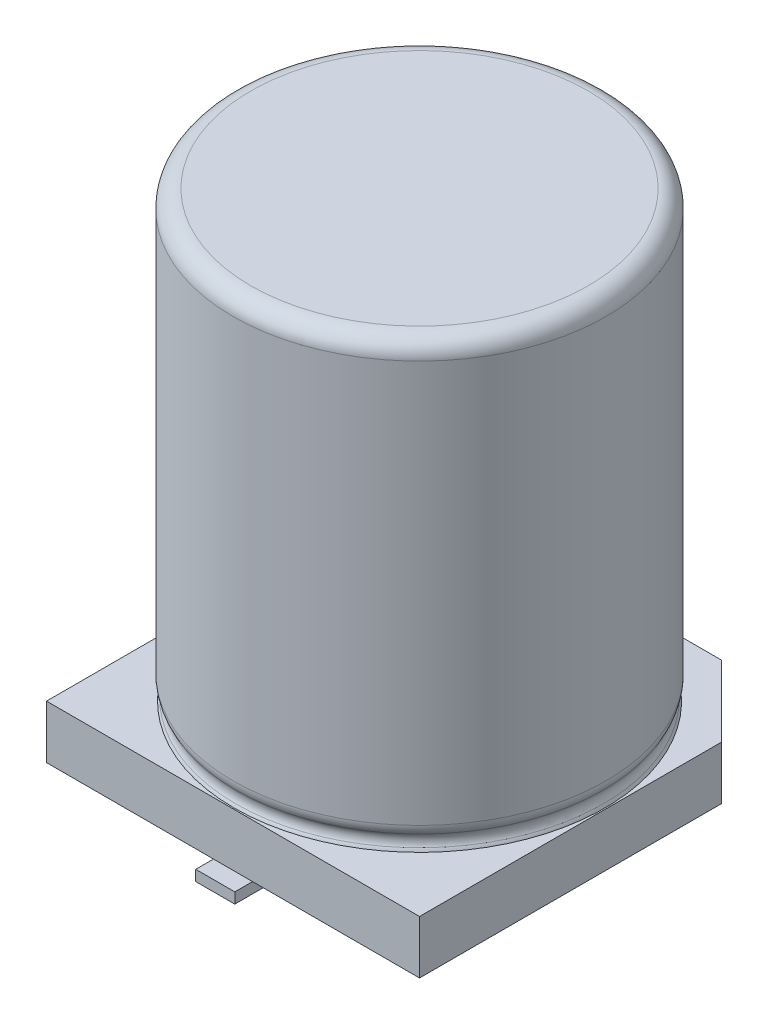
ISO-10303-21;
HEADER;
FILE_DESCRIPTION(('STEP AP214'),'2;1');
FILE_NAME('part.step','',(''),(''),'','','');
FILE_SCHEMA(('AUTOMOTIVE_DESIGN { 1 0 10303 214 1 1 1 1 }'));
ENDSEC;
DATA;
#1=APPLICATION_CONTEXT('core data for automotive mechanical design processes');
#2=APPLICATION_PROTOCOL_DEFINITION('international standard','automotive_design',2000,#1);
#3=PRODUCT_CONTEXT('',#1,'mechanical');
#4=PRODUCT('Part','Part','',(#3));
#5=PRODUCT_RELATED_PRODUCT_CATEGORY('part','',(#4));
#6=PRODUCT_DEFINITION_FORMATION('','',#4);
#7=PRODUCT_DEFINITION_CONTEXT('part definition',#1,'design');
#8=PRODUCT_DEFINITION('design','',#6,#7);
#9=PRODUCT_DEFINITION_SHAPE('','',#8);
#10=(LENGTH_UNIT() NAMED_UNIT(*) SI_UNIT(.MILLI.,.METRE.));
#11=(NAMED_UNIT(*) PLANE_ANGLE_UNIT() SI_UNIT($,.RADIAN.));
#12=(NAMED_UNIT(*) SI_UNIT($,.STERADIAN.) SOLID_ANGLE_UNIT());
#13=UNCERTAINTY_MEASURE_WITH_UNIT(LENGTH_MEASURE(1.E-05),#10,'distance_accuracy_value','');
#14=(GEOMETRIC_REPRESENTATION_CONTEXT(3) GLOBAL_UNCERTAINTY_ASSIGNED_CONTEXT((#13)) GLOBAL_UNIT_ASSIGNED_CONTEXT((#10,
#11,#12)) REPRESENTATION_CONTEXT('',''));
#15=CARTESIAN_POINT('',(0.,0.,0.));
#16=DIRECTION('',(0.,0.,1.));
#17=DIRECTION('',(1.,0.,0.));
#18=AXIS2_PLACEMENT_3D('',#15,#16,#17);
#19=CARTESIAN_POINT('',(0.,0.,0.));
#20=DIRECTION('',(0.,1.,0.));
#21=DIRECTION('',(0.,0.,1.));
#22=AXIS2_PLACEMENT_3D('',#19,#20,#21);
#23=PLANE('',#22);
#24=DIRECTION('',(1.,0.,0.));
#25=VECTOR('',#24,1.);
#26=CARTESIAN_POINT('',(-0.55,0.,-2.34999998300001));
#27=LINE('',#26,#25);
#28=CARTESIAN_POINT('',(-0.55,0.,-2.34999998300001));
#29=VERTEX_POINT('',#28);
#30=CARTESIAN_POINT('',(0.55,0.,-2.34999998300001));
#31=VERTEX_POINT('',#30);
#32=EDGE_CURVE('E146',#29,#31,#27,.T.);
#33=ORIENTED_EDGE('',*,*,#32,.F.);
#34=DIRECTION('',(0.,0.,1.));
#35=VECTOR('',#34,1.);
#36=CARTESIAN_POINT('',(-0.55,0.,-2.34999998300001));
#37=LINE('',#36,#35);
#38=CARTESIAN_POINT('',(-0.55,0.,-5.750000041));
#39=VERTEX_POINT('',#38);
#40=EDGE_CURVE('E144',#39,#29,#37,.T.);
#41=ORIENTED_EDGE('',*,*,#40,.F.);
#42=DIRECTION('',(-1.,0.,0.));
#43=VECTOR('',#42,1.);
#44=CARTESIAN_POINT('',(-0.55,0.,-5.750000041));
#45=LINE('',#44,#43);
#46=CARTESIAN_POINT('',(0.55,0.,-5.750000041));
#47=VERTEX_POINT('',#46);
#48=EDGE_CURVE('E132',#47,#39,#45,.T.);
#49=ORIENTED_EDGE('',*,*,#48,.F.);
#50=DIRECTION('',(0.,0.,-1.));
#51=VECTOR('',#50,1.);
#52=CARTESIAN_POINT('',(0.55,0.,-2.34999998300001));
#53=LINE('',#52,#51);
#54=EDGE_CURVE('E570',#31,#47,#53,.T.);
#55=ORIENTED_EDGE('',*,*,#54,.F.);
#56=EDGE_LOOP('',(#33,#41,#49,#55));
#57=FACE_BOUND('',#56,.T.);
#58=ADVANCED_FACE('F14',(#57),#23,.F.);
#59=CARTESIAN_POINT('',(0.,0.,0.));
#60=DIRECTION('',(0.,1.,0.));
#61=DIRECTION('',(0.,0.,1.));
#62=AXIS2_PLACEMENT_3D('',#59,#60,#61);
#63=PLANE('',#62);
#64=DIRECTION('',(-1.,0.,0.));
#65=VECTOR('',#64,1.);
#66=CARTESIAN_POINT('',(-0.55,0.,5.750000041));
#67=LINE('',#66,#65);
#68=CARTESIAN_POINT('',(0.55,0.,5.750000041));
#69=VERTEX_POINT('',#68);
#70=CARTESIAN_POINT('',(-0.55,0.,5.750000041));
#71=VERTEX_POINT('',#70);
#72=EDGE_CURVE('E532',#69,#71,#67,.T.);
#73=ORIENTED_EDGE('',*,*,#72,.T.);
#74=DIRECTION('',(0.,0.,-1.));
#75=VECTOR('',#74,1.);
#76=CARTESIAN_POINT('',(-0.55,0.,2.34999998300001));
#77=LINE('',#76,#75);
#78=CARTESIAN_POINT('',(-0.55,0.,2.34999998300001));
#79=VERTEX_POINT('',#78);
#80=EDGE_CURVE('E534',#71,#79,#77,.T.);
#81=ORIENTED_EDGE('',*,*,#80,.T.);
#82=DIRECTION('',(1.,0.,0.));
#83=VECTOR('',#82,1.);
#84=CARTESIAN_POINT('',(-0.55,0.,2.34999998300001));
#85=LINE('',#84,#83);
#86=CARTESIAN_POINT('',(0.55,0.,2.34999998300001));
#87=VERTEX_POINT('',#86);
#88=EDGE_CURVE('E149',#79,#87,#85,.T.);
#89=ORIENTED_EDGE('',*,*,#88,.T.);
#90=DIRECTION('',(0.,0.,1.));
#91=VECTOR('',#90,1.);
#92=CARTESIAN_POINT('',(0.55,0.,2.34999998300001));
#93=LINE('',#92,#91);
#94=EDGE_CURVE('E537',#87,#69,#93,.T.);
#95=ORIENTED_EDGE('',*,*,#94,.T.);
#96=EDGE_LOOP('',(#73,#81,#89,#95));
#97=FACE_BOUND('',#96,.T.);
#98=ADVANCED_FACE('F253',(#97),#63,.F.);
#99=CARTESIAN_POINT('',(-0.55,0.,-5.750000041));
#100=DIRECTION('',(0.,0.,-1.));
#101=DIRECTION('',(-1.,0.,0.));
#102=AXIS2_PLACEMENT_3D('',#99,#100,#101);
#103=PLANE('',#102);
#104=ORIENTED_EDGE('',*,*,#48,.T.);
#105=DIRECTION('',(0.,1.,0.));
#106=VECTOR('',#105,1.);
#107=CARTESIAN_POINT('',(-0.55,0.,-5.750000041));
#108=LINE('',#107,#106);
#109=CARTESIAN_POINT('',(-0.55,0.3,-5.750000041));
#110=VERTEX_POINT('',#109);
#111=EDGE_CURVE('E138',#110,#39,#108,.F.);
#112=ORIENTED_EDGE('',*,*,#111,.F.);
#113=DIRECTION('',(1.,0.,0.));
#114=VECTOR('',#113,1.);
#115=CARTESIAN_POINT('',(0.,0.3,-5.750000041));
#116=LINE('',#115,#114);
#117=CARTESIAN_POINT('',(0.55,0.3,-5.750000041));
#118=VERTEX_POINT('',#117);
#119=EDGE_CURVE('E601',#118,#110,#116,.F.);
#120=ORIENTED_EDGE('',*,*,#119,.F.);
#121=DIRECTION('',(0.,1.,0.));
#122=VECTOR('',#121,1.);
#123=CARTESIAN_POINT('',(0.55,0.,-5.750000041));
#124=LINE('',#123,#122);
#125=EDGE_CURVE('E140',#47,#118,#124,.T.);
#126=ORIENTED_EDGE('',*,*,#125,.F.);
#127=EDGE_LOOP('',(#104,#112,#120,#126));
#128=FACE_BOUND('',#127,.T.);
#129=ADVANCED_FACE('F135',(#128),#103,.T.);
#130=CARTESIAN_POINT('',(-0.55,0.,-2.34999998300001));
#131=DIRECTION('',(-1.,0.,0.));
#132=DIRECTION('',(0.,0.,1.));
#133=AXIS2_PLACEMENT_3D('',#130,#131,#132);
#134=PLANE('',#133);
#135=DIRECTION('',(0.,1.,0.));
#136=VECTOR('',#135,1.);
#137=CARTESIAN_POINT('',(-0.55,0.,-2.34999998300001));
#138=LINE('',#137,#136);
#139=CARTESIAN_POINT('',(-0.55,0.3,-2.34999998300001));
#140=VERTEX_POINT('',#139);
#141=EDGE_CURVE('E567',#140,#29,#138,.F.);
#142=ORIENTED_EDGE('',*,*,#141,.F.);
#143=DIRECTION('',(0.,0.,1.));
#144=VECTOR('',#143,1.);
#145=CARTESIAN_POINT('',(-0.55,0.3,0.));
#146=LINE('',#145,#144);
#147=CARTESIAN_POINT('',(-0.55,0.3,-5.250000041));
#148=VERTEX_POINT('',#147);
#149=EDGE_CURVE('E599',#140,#148,#146,.F.);
#150=ORIENTED_EDGE('',*,*,#149,.T.);
#151=DIRECTION('',(0.,0.,1.));
#152=VECTOR('',#151,1.);
#153=CARTESIAN_POINT('',(-0.55,0.3,0.));
#154=LINE('',#153,#152);
#155=EDGE_CURVE('E153',#110,#148,#154,.T.);
#156=ORIENTED_EDGE('',*,*,#155,.F.);
#157=ORIENTED_EDGE('',*,*,#111,.T.);
#158=ORIENTED_EDGE('',*,*,#40,.T.);
#159=EDGE_LOOP('',(#142,#150,#156,#157,#158));
#160=FACE_BOUND('',#159,.T.);
#161=ADVANCED_FACE('F151',(#160),#134,.T.);
#162=CARTESIAN_POINT('',(-0.55,0.,2.34999998300001));
#163=DIRECTION('',(0.,0.,1.));
#164=DIRECTION('',(1.,0.,0.));
#165=AXIS2_PLACEMENT_3D('',#162,#163,#164);
#166=PLANE('',#165);
#167=DIRECTION('',(0.,1.,0.));
#168=VECTOR('',#167,1.);
#169=CARTESIAN_POINT('',(0.55,0.,2.34999998300001));
#170=LINE('',#169,#168);
#171=CARTESIAN_POINT('',(0.55,0.3,2.34999998300001));
#172=VERTEX_POINT('',#171);
#173=EDGE_CURVE('E560',#172,#87,#170,.F.);
#174=ORIENTED_EDGE('',*,*,#173,.T.);
#175=ORIENTED_EDGE('',*,*,#88,.F.);
#176=DIRECTION('',(0.,1.,0.));
#177=VECTOR('',#176,1.);
#178=CARTESIAN_POINT('',(-0.55,0.,2.34999998300001));
#179=LINE('',#178,#177);
#180=CARTESIAN_POINT('',(-0.55,0.3,2.34999998300001));
#181=VERTEX_POINT('',#180);
#182=EDGE_CURVE('E547',#79,#181,#179,.T.);
#183=ORIENTED_EDGE('',*,*,#182,.T.);
#184=DIRECTION('',(1.,0.,0.));
#185=VECTOR('',#184,1.);
#186=CARTESIAN_POINT('',(-5.25,0.3,2.34999998300001));
#187=LINE('',#186,#185);
#188=EDGE_CURVE('E573',#181,#172,#187,.T.);
#189=ORIENTED_EDGE('',*,*,#188,.T.);
#190=EDGE_LOOP('',(#174,#175,#183,#189));
#191=FACE_BOUND('',#190,.T.);
#192=ADVANCED_FACE('F245',(#191),#166,.F.);
#193=CARTESIAN_POINT('',(0.55,0.,-2.34999998300001));
#194=DIRECTION('',(1.,0.,0.));
#195=DIRECTION('',(0.,0.,-1.));
#196=AXIS2_PLACEMENT_3D('',#193,#194,#195);
#197=PLANE('',#196);
#198=ORIENTED_EDGE('',*,*,#125,.T.);
#199=DIRECTION('',(0.,0.,1.));
#200=VECTOR('',#199,1.);
#201=CARTESIAN_POINT('',(0.55,0.3,0.));
#202=LINE('',#201,#200);
#203=CARTESIAN_POINT('',(0.55,0.3,-5.250000041));
#204=VERTEX_POINT('',#203);
#205=EDGE_CURVE('E553',#204,#118,#202,.F.);
#206=ORIENTED_EDGE('',*,*,#205,.F.);
#207=DIRECTION('',(0.,0.,1.));
#208=VECTOR('',#207,1.);
#209=CARTESIAN_POINT('',(0.55,0.3,0.));
#210=LINE('',#209,#208);
#211=CARTESIAN_POINT('',(0.55,0.3,-2.34999998300001));
#212=VERTEX_POINT('',#211);
#213=EDGE_CURVE('E592',#204,#212,#210,.T.);
#214=ORIENTED_EDGE('',*,*,#213,.T.);
#215=DIRECTION('',(0.,1.,0.));
#216=VECTOR('',#215,1.);
#217=CARTESIAN_POINT('',(0.55,0.,-2.34999998300001));
#218=LINE('',#217,#216);
#219=EDGE_CURVE('E563',#31,#212,#218,.T.);
#220=ORIENTED_EDGE('',*,*,#219,.F.);
#221=ORIENTED_EDGE('',*,*,#54,.T.);
#222=EDGE_LOOP('',(#198,#206,#214,#220,#221));
#223=FACE_BOUND('',#222,.T.);
#224=ADVANCED_FACE('F241',(#223),#197,.T.);
#225=CARTESIAN_POINT('',(-0.55,0.,-2.34999998300001));
#226=DIRECTION('',(0.,0.,1.));
#227=DIRECTION('',(1.,0.,0.));
#228=AXIS2_PLACEMENT_3D('',#225,#226,#227);
#229=PLANE('',#228);
#230=ORIENTED_EDGE('',*,*,#32,.T.);
#231=ORIENTED_EDGE('',*,*,#219,.T.);
#232=DIRECTION('',(1.,0.,0.));
#233=VECTOR('',#232,1.);
#234=CARTESIAN_POINT('',(-5.25,0.3,-2.34999998300001));
#235=LINE('',#234,#233);
#236=EDGE_CURVE('E589',#212,#140,#235,.F.);
#237=ORIENTED_EDGE('',*,*,#236,.T.);
#238=ORIENTED_EDGE('',*,*,#141,.T.);
#239=EDGE_LOOP('',(#230,#231,#237,#238));
#240=FACE_BOUND('',#239,.T.);
#241=ADVANCED_FACE('F237',(#240),#229,.T.);
#242=CARTESIAN_POINT('',(0.55,0.,2.34999998300001));
#243=DIRECTION('',(-1.,0.,0.));
#244=DIRECTION('',(0.,0.,1.));
#245=AXIS2_PLACEMENT_3D('',#242,#243,#244);
#246=PLANE('',#245);
#247=DIRECTION('',(0.,0.,1.));
#248=VECTOR('',#247,1.);
#249=CARTESIAN_POINT('',(0.55,0.3,0.));
#250=LINE('',#249,#248);
#251=CARTESIAN_POINT('',(0.55,0.3,5.750000041));
#252=VERTEX_POINT('',#251);
#253=CARTESIAN_POINT('',(0.55,0.3,5.250000041));
#254=VERTEX_POINT('',#253);
#255=EDGE_CURVE('E576',#252,#254,#250,.F.);
#256=ORIENTED_EDGE('',*,*,#255,.F.);
#257=DIRECTION('',(0.,1.,0.));
#258=VECTOR('',#257,1.);
#259=CARTESIAN_POINT('',(0.55,0.,5.750000041));
#260=LINE('',#259,#258);
#261=EDGE_CURVE('E542',#252,#69,#260,.F.);
#262=ORIENTED_EDGE('',*,*,#261,.T.);
#263=ORIENTED_EDGE('',*,*,#94,.F.);
#264=ORIENTED_EDGE('',*,*,#173,.F.);
#265=DIRECTION('',(0.,0.,1.));
#266=VECTOR('',#265,1.);
#267=CARTESIAN_POINT('',(0.55,0.3,0.));
#268=LINE('',#267,#266);
#269=EDGE_CURVE('E594',#172,#254,#268,.T.);
#270=ORIENTED_EDGE('',*,*,#269,.T.);
#271=EDGE_LOOP('',(#256,#262,#263,#264,#270));
#272=FACE_BOUND('',#271,.T.);
#273=ADVANCED_FACE('F233',(#272),#246,.F.);
#274=CARTESIAN_POINT('',(-0.55,0.,2.34999998300001));
#275=DIRECTION('',(1.,0.,0.));
#276=DIRECTION('',(0.,0.,-1.));
#277=AXIS2_PLACEMENT_3D('',#274,#275,#276);
#278=PLANE('',#277);
#279=DIRECTION('',(0.,0.,1.));
#280=VECTOR('',#279,1.);
#281=CARTESIAN_POINT('',(-0.55,0.3,0.));
#282=LINE('',#281,#280);
#283=CARTESIAN_POINT('',(-0.55,0.3,5.250000041));
#284=VERTEX_POINT('',#283);
#285=EDGE_CURVE('E597',#284,#181,#282,.F.);
#286=ORIENTED_EDGE('',*,*,#285,.T.);
#287=ORIENTED_EDGE('',*,*,#182,.F.);
#288=ORIENTED_EDGE('',*,*,#80,.F.);
#289=DIRECTION('',(0.,1.,0.));
#290=VECTOR('',#289,1.);
#291=CARTESIAN_POINT('',(-0.55,0.,5.750000041));
#292=LINE('',#291,#290);
#293=CARTESIAN_POINT('',(-0.55,0.3,5.750000041));
#294=VERTEX_POINT('',#293);
#295=EDGE_CURVE('E541',#71,#294,#292,.T.);
#296=ORIENTED_EDGE('',*,*,#295,.T.);
#297=DIRECTION('',(0.,0.,1.));
#298=VECTOR('',#297,1.);
#299=CARTESIAN_POINT('',(-0.55,0.3,0.));
#300=LINE('',#299,#298);
#301=EDGE_CURVE('E579',#284,#294,#300,.T.);
#302=ORIENTED_EDGE('',*,*,#301,.F.);
#303=EDGE_LOOP('',(#286,#287,#288,#296,#302));
#304=FACE_BOUND('',#303,.T.);
#305=ADVANCED_FACE('F229',(#304),#278,.F.);
#306=CARTESIAN_POINT('',(-0.55,0.,5.750000041));
#307=DIRECTION('',(0.,0.,-1.));
#308=DIRECTION('',(-1.,0.,0.));
#309=AXIS2_PLACEMENT_3D('',#306,#307,#308);
#310=PLANE('',#309);
#311=ORIENTED_EDGE('',*,*,#295,.F.);
#312=ORIENTED_EDGE('',*,*,#72,.F.);
#313=ORIENTED_EDGE('',*,*,#261,.F.);
#314=DIRECTION('',(1.,0.,0.));
#315=VECTOR('',#314,1.);
#316=CARTESIAN_POINT('',(0.,0.3,5.750000041));
#317=LINE('',#316,#315);
#318=EDGE_CURVE('E550',#294,#252,#317,.T.);
#319=ORIENTED_EDGE('',*,*,#318,.F.);
#320=EDGE_LOOP('',(#311,#312,#313,#319));
#321=FACE_BOUND('',#320,.T.);
#322=ADVANCED_FACE('F225',(#321),#310,.F.);
#323=CARTESIAN_POINT('',(0.,0.3,0.));
#324=DIRECTION('',(0.,1.,0.));
#325=DIRECTION('',(0.,0.,1.));
#326=AXIS2_PLACEMENT_3D('',#323,#324,#325);
#327=PLANE('',#326);
#328=ORIENTED_EDGE('',*,*,#205,.T.);
#329=ORIENTED_EDGE('',*,*,#119,.T.);
#330=ORIENTED_EDGE('',*,*,#155,.T.);
#331=DIRECTION('',(-1.,0.,0.));
#332=VECTOR('',#331,1.);
#333=CARTESIAN_POINT('',(-3.25,0.3,-5.250000041));
#334=LINE('',#333,#332);
#335=EDGE_CURVE('E605',#204,#148,#334,.T.);
#336=ORIENTED_EDGE('',*,*,#335,.F.);
#337=EDGE_LOOP('',(#328,#329,#330,#336));
#338=FACE_BOUND('',#337,.T.);
#339=ADVANCED_FACE('F221',(#338),#327,.T.);
#340=CARTESIAN_POINT('',(-5.25,0.3,0.));
#341=DIRECTION('',(0.,1.,0.));
#342=DIRECTION('',(0.,0.,1.));
#343=AXIS2_PLACEMENT_3D('',#340,#341,#342);
#344=PLANE('',#343);
#345=ORIENTED_EDGE('',*,*,#213,.F.);
#346=DIRECTION('',(-1.,0.,0.));
#347=VECTOR('',#346,1.);
#348=CARTESIAN_POINT('',(-3.25,0.3,-5.250000041));
#349=LINE('',#348,#347);
#350=CARTESIAN_POINT('',(3.25,0.299999999999999,-5.250000041));
#351=VERTEX_POINT('',#350);
#352=EDGE_CURVE('E611',#351,#204,#349,.T.);
#353=ORIENTED_EDGE('',*,*,#352,.F.);
#354=DIRECTION('',(-0.707106781186548,0.,-0.707106781186548));
#355=VECTOR('',#354,1.);
#356=CARTESIAN_POINT('',(3.25,0.299999999999999,-5.250000041));
#357=LINE('',#356,#355);
#358=CARTESIAN_POINT('',(5.250000041,0.3,-3.25));
#359=VERTEX_POINT('',#358);
#360=EDGE_CURVE('E583',#359,#351,#357,.T.);
#361=ORIENTED_EDGE('',*,*,#360,.F.);
#362=DIRECTION('',(0.,0.,-1.));
#363=VECTOR('',#362,1.);
#364=CARTESIAN_POINT('',(5.250000041,0.3,-3.25));
#365=LINE('',#364,#363);
#366=CARTESIAN_POINT('',(5.250000041,0.3,5.250000041));
#367=VERTEX_POINT('',#366);
#368=EDGE_CURVE('E580',#367,#359,#365,.T.);
#369=ORIENTED_EDGE('',*,*,#368,.F.);
#370=DIRECTION('',(1.,0.,0.));
#371=VECTOR('',#370,1.);
#372=CARTESIAN_POINT('',(-5.250000041,0.3,5.250000041));
#373=LINE('',#372,#371);
#374=EDGE_CURVE('E643',#254,#367,#373,.T.);
#375=ORIENTED_EDGE('',*,*,#374,.F.);
#376=ORIENTED_EDGE('',*,*,#269,.F.);
#377=ORIENTED_EDGE('',*,*,#188,.F.);
#378=ORIENTED_EDGE('',*,*,#285,.F.);
#379=DIRECTION('',(1.,0.,0.));
#380=VECTOR('',#379,1.);
#381=CARTESIAN_POINT('',(-5.250000041,0.3,5.250000041));
#382=LINE('',#381,#380);
#383=CARTESIAN_POINT('',(-5.250000041,0.3,5.250000041));
#384=VERTEX_POINT('',#383);
#385=EDGE_CURVE('E669',#384,#284,#382,.T.);
#386=ORIENTED_EDGE('',*,*,#385,.F.);
#387=DIRECTION('',(0.,0.,1.));
#388=VECTOR('',#387,1.);
#389=CARTESIAN_POINT('',(-5.250000041,0.3,-3.25));
#390=LINE('',#389,#388);
#391=CARTESIAN_POINT('',(-5.250000041,0.3,-3.25));
#392=VERTEX_POINT('',#391);
#393=EDGE_CURVE('E650',#392,#384,#390,.T.);
#394=ORIENTED_EDGE('',*,*,#393,.F.);
#395=DIRECTION('',(-0.707106781186548,0.,0.707106781186548));
#396=VECTOR('',#395,1.);
#397=CARTESIAN_POINT('',(-5.250000041,0.299999999999999,-3.25));
#398=LINE('',#397,#396);
#399=CARTESIAN_POINT('',(-3.25,0.3,-5.250000041));
#400=VERTEX_POINT('',#399);
#401=EDGE_CURVE('E618',#400,#392,#398,.T.);
#402=ORIENTED_EDGE('',*,*,#401,.F.);
#403=DIRECTION('',(-1.,0.,0.));
#404=VECTOR('',#403,1.);
#405=CARTESIAN_POINT('',(-3.25,0.3,-5.250000041));
#406=LINE('',#405,#404);
#407=EDGE_CURVE('E616',#148,#400,#406,.T.);
#408=ORIENTED_EDGE('',*,*,#407,.F.);
#409=ORIENTED_EDGE('',*,*,#149,.F.);
#410=ORIENTED_EDGE('',*,*,#236,.F.);
#411=EDGE_LOOP('',(#345,#353,#361,#369,#375,#376,#377,#378,#386,#394,#402,#408,#409,#410));
#412=FACE_BOUND('',#411,.T.);
#413=ADVANCED_FACE('F217',(#412),#344,.F.);
#414=CARTESIAN_POINT('',(0.,0.3,0.));
#415=DIRECTION('',(0.,1.,0.));
#416=DIRECTION('',(0.,0.,1.));
#417=AXIS2_PLACEMENT_3D('',#414,#415,#416);
#418=PLANE('',#417);
#419=ORIENTED_EDGE('',*,*,#301,.T.);
#420=ORIENTED_EDGE('',*,*,#318,.T.);
#421=ORIENTED_EDGE('',*,*,#255,.T.);
#422=DIRECTION('',(1.,0.,0.));
#423=VECTOR('',#422,1.);
#424=CARTESIAN_POINT('',(-5.250000041,0.3,5.250000041));
#425=LINE('',#424,#423);
#426=EDGE_CURVE('E646',#284,#254,#425,.T.);
#427=ORIENTED_EDGE('',*,*,#426,.F.);
#428=EDGE_LOOP('',(#419,#420,#421,#427));
#429=FACE_BOUND('',#428,.T.);
#430=ADVANCED_FACE('F213',(#429),#418,.T.);
#431=CARTESIAN_POINT('',(5.250000041,1.8,-3.25));
#432=DIRECTION('',(1.,0.,0.));
#433=DIRECTION('',(0.,0.,-1.));
#434=AXIS2_PLACEMENT_3D('',#431,#432,#433);
#435=PLANE('',#434);
#436=DIRECTION('',(0.,0.,1.));
#437=VECTOR('',#436,1.);
#438=CARTESIAN_POINT('',(5.250000041,1.8,0.));
#439=LINE('',#438,#437);
#440=CARTESIAN_POINT('',(5.250000041,1.8,5.250000041));
#441=VERTEX_POINT('',#440);
#442=CARTESIAN_POINT('',(5.250000041,1.8,-3.25));
#443=VERTEX_POINT('',#442);
#444=EDGE_CURVE('E639',#441,#443,#439,.F.);
#445=ORIENTED_EDGE('',*,*,#444,.F.);
#446=DIRECTION('',(0.,1.,0.));
#447=VECTOR('',#446,1.);
#448=CARTESIAN_POINT('',(5.250000041,1.8,5.250000041));
#449=LINE('',#448,#447);
#450=EDGE_CURVE('E636',#367,#441,#449,.T.);
#451=ORIENTED_EDGE('',*,*,#450,.F.);
#452=ORIENTED_EDGE('',*,*,#368,.T.);
#453=DIRECTION('',(0.,1.,0.));
#454=VECTOR('',#453,1.);
#455=CARTESIAN_POINT('',(5.250000041,1.8,-3.25));
#456=LINE('',#455,#454);
#457=EDGE_CURVE('E621',#443,#359,#456,.F.);
#458=ORIENTED_EDGE('',*,*,#457,.F.);
#459=EDGE_LOOP('',(#445,#451,#452,#458));
#460=FACE_BOUND('',#459,.T.);
#461=ADVANCED_FACE('F209',(#460),#435,.T.);
#462=CARTESIAN_POINT('',(3.25,1.8,-5.250000041));
#463=DIRECTION('',(0.707106781186548,0.,-0.707106781186548));
#464=DIRECTION('',(-0.707106781186548,0.,-0.707106781186548));
#465=AXIS2_PLACEMENT_3D('',#462,#463,#464);
#466=PLANE('',#465);
#467=DIRECTION('',(-0.707106781186548,0.,-0.707106781186548));
#468=VECTOR('',#467,1.);
#469=CARTESIAN_POINT('',(5.250000041,1.8,-3.25));
#470=LINE('',#469,#468);
#471=CARTESIAN_POINT('',(3.25,1.8,-5.250000041));
#472=VERTEX_POINT('',#471);
#473=EDGE_CURVE('E660',#443,#472,#470,.T.);
#474=ORIENTED_EDGE('',*,*,#473,.F.);
#475=ORIENTED_EDGE('',*,*,#457,.T.);
#476=ORIENTED_EDGE('',*,*,#360,.T.);
#477=DIRECTION('',(0.,1.,0.));
#478=VECTOR('',#477,1.);
#479=CARTESIAN_POINT('',(3.25,1.8,-5.250000041));
#480=LINE('',#479,#478);
#481=EDGE_CURVE('E620',#472,#351,#480,.F.);
#482=ORIENTED_EDGE('',*,*,#481,.F.);
#483=EDGE_LOOP('',(#474,#475,#476,#482));
#484=FACE_BOUND('',#483,.T.);
#485=ADVANCED_FACE('F205',(#484),#466,.T.);
#486=CARTESIAN_POINT('',(-3.25,1.8,-5.250000041));
#487=DIRECTION('',(0.,0.,-1.));
#488=DIRECTION('',(-1.,0.,0.));
#489=AXIS2_PLACEMENT_3D('',#486,#487,#488);
#490=PLANE('',#489);
#491=ORIENTED_EDGE('',*,*,#352,.T.);
#492=ORIENTED_EDGE('',*,*,#335,.T.);
#493=ORIENTED_EDGE('',*,*,#407,.T.);
#494=DIRECTION('',(0.,1.,0.));
#495=VECTOR('',#494,1.);
#496=CARTESIAN_POINT('',(-3.25,1.8,-5.250000041));
#497=LINE('',#496,#495);
#498=CARTESIAN_POINT('',(-3.25,1.8,-5.250000041));
#499=VERTEX_POINT('',#498);
#500=EDGE_CURVE('E624',#499,#400,#497,.F.);
#501=ORIENTED_EDGE('',*,*,#500,.F.);
#502=DIRECTION('',(1.,0.,0.));
#503=VECTOR('',#502,1.);
#504=CARTESIAN_POINT('',(0.,1.8,-5.250000041));
#505=LINE('',#504,#503);
#506=EDGE_CURVE('E658',#472,#499,#505,.F.);
#507=ORIENTED_EDGE('',*,*,#506,.F.);
#508=ORIENTED_EDGE('',*,*,#481,.T.);
#509=EDGE_LOOP('',(#491,#492,#493,#501,#507,#508));
#510=FACE_BOUND('',#509,.T.);
#511=ADVANCED_FACE('F201',(#510),#490,.T.);
#512=CARTESIAN_POINT('',(-5.250000041,1.8,-3.25));
#513=DIRECTION('',(-0.707106781186548,0.,-0.707106781186548));
#514=DIRECTION('',(-0.707106781186548,0.,0.707106781186548));
#515=AXIS2_PLACEMENT_3D('',#512,#513,#514);
#516=PLANE('',#515);
#517=DIRECTION('',(-0.707106781186548,0.,0.707106781186548));
#518=VECTOR('',#517,1.);
#519=CARTESIAN_POINT('',(-3.25,1.8,-5.250000041));
#520=LINE('',#519,#518);
#521=CARTESIAN_POINT('',(-5.250000041,1.8,-3.25));
#522=VERTEX_POINT('',#521);
#523=EDGE_CURVE('E656',#499,#522,#520,.T.);
#524=ORIENTED_EDGE('',*,*,#523,.F.);
#525=ORIENTED_EDGE('',*,*,#500,.T.);
#526=ORIENTED_EDGE('',*,*,#401,.T.);
#527=DIRECTION('',(0.,1.,0.));
#528=VECTOR('',#527,1.);
#529=CARTESIAN_POINT('',(-5.250000041,1.8,-3.25));
#530=LINE('',#529,#528);
#531=EDGE_CURVE('E647',#522,#392,#530,.F.);
#532=ORIENTED_EDGE('',*,*,#531,.F.);
#533=EDGE_LOOP('',(#524,#525,#526,#532));
#534=FACE_BOUND('',#533,.T.);
#535=ADVANCED_FACE('F197',(#534),#516,.T.);
#536=CARTESIAN_POINT('',(-5.250000041,1.8,-3.25));
#537=DIRECTION('',(-1.,0.,0.));
#538=DIRECTION('',(0.,0.,1.));
#539=AXIS2_PLACEMENT_3D('',#536,#537,#538);
#540=PLANE('',#539);
#541=DIRECTION('',(0.,0.,1.));
#542=VECTOR('',#541,1.);
#543=CARTESIAN_POINT('',(-5.250000041,1.8,0.));
#544=LINE('',#543,#542);
#545=CARTESIAN_POINT('',(-5.250000041,1.8,5.250000041));
#546=VERTEX_POINT('',#545);
#547=EDGE_CURVE('E673',#522,#546,#544,.T.);
#548=ORIENTED_EDGE('',*,*,#547,.F.);
#549=ORIENTED_EDGE('',*,*,#531,.T.);
#550=ORIENTED_EDGE('',*,*,#393,.T.);
#551=DIRECTION('',(0.,1.,0.));
#552=VECTOR('',#551,1.);
#553=CARTESIAN_POINT('',(-5.250000041,1.8,5.250000041));
#554=LINE('',#553,#552);
#555=EDGE_CURVE('E642',#546,#384,#554,.F.);
#556=ORIENTED_EDGE('',*,*,#555,.F.);
#557=EDGE_LOOP('',(#548,#549,#550,#556));
#558=FACE_BOUND('',#557,.T.);
#559=ADVANCED_FACE('F193',(#558),#540,.T.);
#560=CARTESIAN_POINT('',(-5.250000041,1.8,5.250000041));
#561=DIRECTION('',(0.,0.,1.));
#562=DIRECTION('',(1.,0.,0.));
#563=AXIS2_PLACEMENT_3D('',#560,#561,#562);
#564=PLANE('',#563);
#565=ORIENTED_EDGE('',*,*,#385,.T.);
#566=ORIENTED_EDGE('',*,*,#426,.T.);
#567=ORIENTED_EDGE('',*,*,#374,.T.);
#568=ORIENTED_EDGE('',*,*,#450,.T.);
#569=DIRECTION('',(1.,0.,0.));
#570=VECTOR('',#569,1.);
#571=CARTESIAN_POINT('',(0.,1.8,5.250000041));
#572=LINE('',#571,#570);
#573=EDGE_CURVE('E161',#546,#441,#572,.T.);
#574=ORIENTED_EDGE('',*,*,#573,.F.);
#575=ORIENTED_EDGE('',*,*,#555,.T.);
#576=EDGE_LOOP('',(#565,#566,#567,#568,#574,#575));
#577=FACE_BOUND('',#576,.T.);
#578=ADVANCED_FACE('F189',(#577),#564,.T.);
#579=CARTESIAN_POINT('',(0.,1.8,0.));
#580=DIRECTION('',(0.,1.,0.));
#581=DIRECTION('',(0.,0.,1.));
#582=AXIS2_PLACEMENT_3D('',#579,#580,#581);
#583=PLANE('',#582);
#584=ORIENTED_EDGE('',*,*,#547,.T.);
#585=ORIENTED_EDGE('',*,*,#573,.T.);
#586=ORIENTED_EDGE('',*,*,#444,.T.);
#587=ORIENTED_EDGE('',*,*,#473,.T.);
#588=ORIENTED_EDGE('',*,*,#506,.T.);
#589=ORIENTED_EDGE('',*,*,#523,.T.);
#590=EDGE_LOOP('',(#584,#585,#586,#587,#588,#589));
#591=FACE_BOUND('',#590,.T.);
#592=CARTESIAN_POINT('',(0.,1.8,0.));
#593=DIRECTION('',(0.,1.,0.));
#594=DIRECTION('',(0.,0.,1.));
#595=AXIS2_PLACEMENT_3D('',#592,#593,#594);
#596=CIRCLE('',#595,5.21598246590086);
#597=CARTESIAN_POINT('',(0.,1.8,5.21598246590086));
#598=VERTEX_POINT('',#597);
#599=EDGE_CURVE('E158',#598,#598,#596,.T.);
#600=ORIENTED_EDGE('',*,*,#599,.F.);
#601=EDGE_LOOP('',(#600));
#602=FACE_BOUND('',#601,.T.);
#603=ADVANCED_FACE('F184',(#591,#602),#583,.T.);
#604=CARTESIAN_POINT('',(0.,1.61872578075879,0.));
#605=DIRECTION('',(0.,1.,0.));
#606=DIRECTION('',(0.,0.,1.));
#607=AXIS2_PLACEMENT_3D('',#604,#605,#606);
#608=TOROIDAL_SURFACE('',#607,4.749999984,0.500000016);
#609=CARTESIAN_POINT('',(0.,1.88337926097058,0.));
#610=DIRECTION('',(0.,-1.,0.));
#611=DIRECTION('',(0.,0.,-1.));
#612=AXIS2_PLACEMENT_3D('',#609,#610,#611);
#613=CIRCLE('',#612,5.17421520226991);
#614=CARTESIAN_POINT('',(0.,1.88337926097058,-5.17421520226991));
#615=VERTEX_POINT('',#614);
#616=EDGE_CURVE('E160',#615,#615,#613,.T.);
#617=ORIENTED_EDGE('',*,*,#616,.T.);
#618=EDGE_LOOP('',(#617));
#619=FACE_BOUND('',#618,.T.);
#620=ORIENTED_EDGE('',*,*,#599,.T.);
#621=EDGE_LOOP('',(#620));
#622=FACE_BOUND('',#621,.T.);
#623=ADVANCED_FACE('F179',(#619,#622),#608,.T.);
#624=CARTESIAN_POINT('',(0.,14.3,0.));
#625=DIRECTION('',(0.,-1.,0.));
#626=DIRECTION('',(0.,0.,-1.));
#627=AXIS2_PLACEMENT_3D('',#624,#625,#626);
#628=PLANE('',#627);
#629=CARTESIAN_POINT('',(0.,14.3,0.));
#630=DIRECTION('',(0.,-1.,0.));
#631=DIRECTION('',(0.,0.,-1.));
#632=AXIS2_PLACEMENT_3D('',#629,#630,#631);
#633=CIRCLE('',#632,4.749999984);
#634=CARTESIAN_POINT('',(0.,14.3,-4.749999984));
#635=VERTEX_POINT('',#634);
#636=CARTESIAN_POINT('',(0.,14.3,4.749999984));
#637=VERTEX_POINT('',#636);
#638=EDGE_CURVE('E164',#635,#637,#633,.T.);
#639=ORIENTED_EDGE('',*,*,#638,.F.);
#640=CARTESIAN_POINT('',(0.,14.3,0.));
#641=DIRECTION('',(0.,-1.,0.));
#642=DIRECTION('',(0.,0.,1.));
#643=AXIS2_PLACEMENT_3D('',#640,#641,#642);
#644=CIRCLE('',#643,4.749999984);
#645=EDGE_CURVE('E33',#637,#635,#644,.T.);
#646=ORIENTED_EDGE('',*,*,#645,.F.);
#647=EDGE_LOOP('',(#639,#646));
#648=FACE_BOUND('',#647,.T.);
#649=ADVANCED_FACE('F183',(#648),#628,.F.);
#650=CARTESIAN_POINT('',(0.,2.05,0.));
#651=DIRECTION('',(0.,-1.,0.));
#652=DIRECTION('',(0.,0.,-1.));
#653=AXIS2_PLACEMENT_3D('',#650,#651,#652);
#654=TOROIDAL_SURFACE('',#653,5.441292941505,0.314790389735192);
#655=ORIENTED_EDGE('',*,*,#616,.F.);
#656=EDGE_LOOP('',(#655));
#657=FACE_BOUND('',#656,.T.);
#658=CARTESIAN_POINT('',(0.,2.21662073902942,0.));
#659=DIRECTION('',(0.,1.,0.));
#660=DIRECTION('',(0.,0.,1.));
#661=AXIS2_PLACEMENT_3D('',#658,#659,#660);
#662=CIRCLE('',#661,5.17421520226991);
#663=CARTESIAN_POINT('',(0.,2.21662073902942,5.17421520226991));
#664=VERTEX_POINT('',#663);
#665=EDGE_CURVE('E166',#664,#664,#662,.T.);
#666=ORIENTED_EDGE('',*,*,#665,.F.);
#667=EDGE_LOOP('',(#666));
#668=FACE_BOUND('',#667,.T.);
#669=ADVANCED_FACE('F283',(#657,#668),#654,.F.);
#670=CARTESIAN_POINT('',(0.,13.799999984,0.));
#671=DIRECTION('',(0.,-1.,0.));
#672=DIRECTION('',(0.,0.,-1.));
#673=AXIS2_PLACEMENT_3D('',#670,#671,#672);
#674=TOROIDAL_SURFACE('',#673,4.749999984,0.500000016);
#675=CARTESIAN_POINT('',(0.,13.799999984,0.));
#676=DIRECTION('',(0.,-1.,0.));
#677=DIRECTION('',(0.,0.,-1.));
#678=AXIS2_PLACEMENT_3D('',#675,#676,#677);
#679=CIRCLE('',#678,5.25);
#680=CARTESIAN_POINT('',(0.,13.799999984,-5.25));
#681=VERTEX_POINT('',#680);
#682=EDGE_CURVE('E25',#681,#681,#679,.T.);
#683=ORIENTED_EDGE('',*,*,#682,.F.);
#684=EDGE_LOOP('',(#683));
#685=FACE_BOUND('',#684,.T.);
#686=ORIENTED_EDGE('',*,*,#638,.T.);
#687=ORIENTED_EDGE('',*,*,#645,.T.);
#688=EDGE_LOOP('',(#686,#687));
#689=FACE_BOUND('',#688,.T.);
#690=ADVANCED_FACE('F163',(#685,#689),#674,.T.);
#691=CARTESIAN_POINT('',(0.,2.48127421924121,0.));
#692=DIRECTION('',(0.,1.,0.));
#693=DIRECTION('',(0.,0.,1.));
#694=AXIS2_PLACEMENT_3D('',#691,#692,#693);
#695=TOROIDAL_SURFACE('',#694,4.749999984,0.500000016);
#696=CARTESIAN_POINT('',(0.,2.48127421924121,0.));
#697=DIRECTION('',(0.,-1.,0.));
#698=DIRECTION('',(0.,0.,-1.));
#699=AXIS2_PLACEMENT_3D('',#696,#697,#698);
#700=CIRCLE('',#699,5.25);
#701=CARTESIAN_POINT('',(0.,2.48127421924121,-5.25));
#702=VERTEX_POINT('',#701);
#703=EDGE_CURVE('E9',#702,#702,#700,.F.);
#704=ORIENTED_EDGE('',*,*,#703,.F.);
#705=EDGE_LOOP('',(#704));
#706=FACE_BOUND('',#705,.T.);
#707=ORIENTED_EDGE('',*,*,#665,.T.);
#708=EDGE_LOOP('',(#707));
#709=FACE_BOUND('',#708,.T.);
#710=ADVANCED_FACE('F262',(#706,#709),#695,.T.);
#711=CARTESIAN_POINT('',(0.,0.3,0.));
#712=DIRECTION('',(0.,-1.,0.));
#713=DIRECTION('',(0.,0.,-1.));
#714=AXIS2_PLACEMENT_3D('',#711,#712,#713);
#715=CYLINDRICAL_SURFACE('',#714,5.25);
#716=ORIENTED_EDGE('',*,*,#703,.T.);
#717=EDGE_LOOP('',(#716));
#718=FACE_BOUND('',#717,.T.);
#719=ORIENTED_EDGE('',*,*,#682,.T.);
#720=EDGE_LOOP('',(#719));
#721=FACE_BOUND('',#720,.T.);
#722=ADVANCED_FACE('F260',(#718,#721),#715,.T.);
#723=CLOSED_SHELL('',(#58,#98,#129,#161,#192,#224,#241,#273,#305,#322,#339,#413,#430,#461,#485,
#511,#535,#559,#578,#603,#623,#649,#669,#690,#710,#722));
#724=MANIFOLD_SOLID_BREP('B1',#723);
#725=ADVANCED_BREP_SHAPE_REPRESENTATION('',(#18,#724),#14);
#726=SHAPE_DEFINITION_REPRESENTATION(#9,#725);
ENDSEC;
END-ISO-10303-21;
